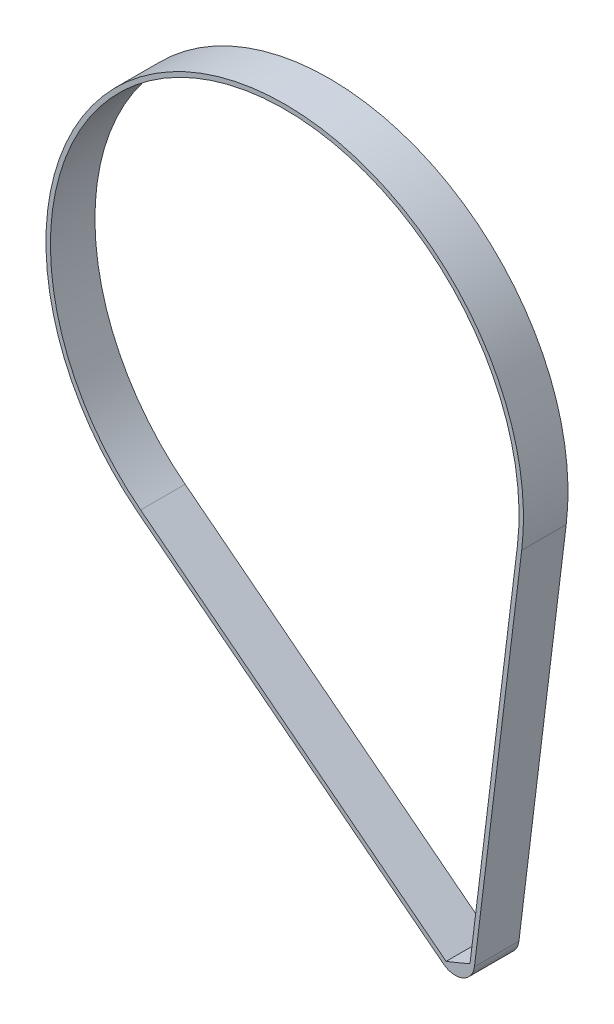
ISO-10303-21;
HEADER;
FILE_DESCRIPTION(('STEP AP214'),'2;1');
FILE_NAME('part.step','',(''),(''),'','','');
FILE_SCHEMA(('AUTOMOTIVE_DESIGN { 1 0 10303 214 1 1 1 1 }'));
ENDSEC;
DATA;
#1=APPLICATION_CONTEXT('core data for automotive mechanical design processes');
#2=APPLICATION_PROTOCOL_DEFINITION('international standard','automotive_design',2000,#1);
#3=PRODUCT_CONTEXT('',#1,'mechanical');
#4=PRODUCT('Part','Part','',(#3));
#5=PRODUCT_RELATED_PRODUCT_CATEGORY('part','',(#4));
#6=PRODUCT_DEFINITION_FORMATION('','',#4);
#7=PRODUCT_DEFINITION_CONTEXT('part definition',#1,'design');
#8=PRODUCT_DEFINITION('design','',#6,#7);
#9=PRODUCT_DEFINITION_SHAPE('','',#8);
#10=(LENGTH_UNIT() NAMED_UNIT(*) SI_UNIT(.MILLI.,.METRE.));
#11=(NAMED_UNIT(*) PLANE_ANGLE_UNIT() SI_UNIT($,.RADIAN.));
#12=(NAMED_UNIT(*) SI_UNIT($,.STERADIAN.) SOLID_ANGLE_UNIT());
#13=UNCERTAINTY_MEASURE_WITH_UNIT(LENGTH_MEASURE(1.E-05),#10,'distance_accuracy_value','');
#14=(GEOMETRIC_REPRESENTATION_CONTEXT(3) GLOBAL_UNCERTAINTY_ASSIGNED_CONTEXT((#13)) GLOBAL_UNIT_ASSIGNED_CONTEXT((#10,
#11,#12)) REPRESENTATION_CONTEXT('',''));
#15=CARTESIAN_POINT('',(0.,0.,0.));
#16=DIRECTION('',(0.,0.,1.));
#17=DIRECTION('',(1.,0.,0.));
#18=AXIS2_PLACEMENT_3D('',#15,#16,#17);
#19=CARTESIAN_POINT('',(0.,0.,-30.));
#20=DIRECTION('',(0.,0.,1.));
#21=DIRECTION('',(1.,0.,0.));
#22=AXIS2_PLACEMENT_3D('',#19,#20,#21);
#23=CYLINDRICAL_SURFACE('',#22,160.89);
#24=CARTESIAN_POINT('',(0.,0.,0.));
#25=DIRECTION('',(0.,0.,1.));
#26=DIRECTION('',(1.,0.,0.));
#27=AXIS2_PLACEMENT_3D('',#24,#25,#26);
#28=CIRCLE('',#27,160.89);
#29=CARTESIAN_POINT('',(159.686268065293,-19.6440294079285,0.));
#30=VERTEX_POINT('',#29);
#31=CARTESIAN_POINT('',(-98.9244243103607,-126.884003620881,0.));
#32=VERTEX_POINT('',#31);
#33=EDGE_CURVE('E133',#30,#32,#28,.T.);
#34=ORIENTED_EDGE('',*,*,#33,.F.);
#35=DIRECTION('',(0.,0.,1.));
#36=VECTOR('',#35,1.);
#37=CARTESIAN_POINT('',(159.686268065293,-19.6440294079285,-30.));
#38=LINE('',#37,#36);
#39=CARTESIAN_POINT('',(159.686268065293,-19.6440294079285,-30.));
#40=VERTEX_POINT('',#39);
#41=EDGE_CURVE('E11',#40,#30,#38,.T.);
#42=ORIENTED_EDGE('',*,*,#41,.F.);
#43=CARTESIAN_POINT('',(0.,0.,-30.));
#44=DIRECTION('',(0.,0.,1.));
#45=DIRECTION('',(1.,0.,0.));
#46=AXIS2_PLACEMENT_3D('',#43,#44,#45);
#47=CIRCLE('',#46,160.89);
#48=CARTESIAN_POINT('',(-98.9244243103607,-126.884003620881,-30.));
#49=VERTEX_POINT('',#48);
#50=EDGE_CURVE('E137',#40,#49,#47,.T.);
#51=ORIENTED_EDGE('',*,*,#50,.T.);
#52=DIRECTION('',(0.,0.,1.));
#53=VECTOR('',#52,1.);
#54=CARTESIAN_POINT('',(-98.9244243103607,-126.884003620881,-30.));
#55=LINE('',#54,#53);
#56=EDGE_CURVE('E38',#49,#32,#55,.T.);
#57=ORIENTED_EDGE('',*,*,#56,.T.);
#58=EDGE_LOOP('',(#34,#42,#51,#57));
#59=FACE_BOUND('',#58,.T.);
#60=ADVANCED_FACE('F35',(#59),#23,.T.);
#61=CARTESIAN_POINT('',(159.686268065293,-19.6440294079285,-30.));
#62=DIRECTION('',(0.992518292406566,-0.122096024662369,0.));
#63=DIRECTION('',(0.122096024662369,0.992518292406566,0.));
#64=AXIS2_PLACEMENT_3D('',#61,#62,#63);
#65=PLANE('',#64);
#66=DIRECTION('',(0.122096024662369,0.992518292406566,0.));
#67=VECTOR('',#66,1.);
#68=CARTESIAN_POINT('',(159.686268065293,-19.6440294079285,0.));
#69=LINE('',#68,#67);
#70=CARTESIAN_POINT('',(127.817440220257,-278.705654724731,0.));
#71=VERTEX_POINT('',#70);
#72=EDGE_CURVE('E141',#71,#30,#69,.T.);
#73=ORIENTED_EDGE('',*,*,#72,.F.);
#74=DIRECTION('',(0.,0.,1.));
#75=VECTOR('',#74,1.);
#76=CARTESIAN_POINT('',(127.817440220257,-278.705654724731,-30.));
#77=LINE('',#76,#75);
#78=CARTESIAN_POINT('',(127.817440220257,-278.705654724731,-30.));
#79=VERTEX_POINT('',#78);
#80=EDGE_CURVE('E43',#79,#71,#77,.T.);
#81=ORIENTED_EDGE('',*,*,#80,.F.);
#82=DIRECTION('',(0.122096024662369,0.992518292406566,0.));
#83=VECTOR('',#82,1.);
#84=CARTESIAN_POINT('',(159.686268065293,-19.6440294079285,-30.));
#85=LINE('',#84,#83);
#86=EDGE_CURVE('E147',#79,#40,#85,.T.);
#87=ORIENTED_EDGE('',*,*,#86,.T.);
#88=ORIENTED_EDGE('',*,*,#41,.T.);
#89=EDGE_LOOP('',(#73,#81,#87,#88));
#90=FACE_BOUND('',#89,.T.);
#91=ADVANCED_FACE('F173',(#90),#65,.T.);
#92=CARTESIAN_POINT('',(114.914702418971,-277.11840640412,-30.));
#93=DIRECTION('',(0.,0.,1.));
#94=DIRECTION('',(1.,0.,0.));
#95=AXIS2_PLACEMENT_3D('',#92,#93,#94);
#96=CYLINDRICAL_SURFACE('',#95,13.);
#97=CARTESIAN_POINT('',(114.914702418971,-277.11840640412,0.));
#98=DIRECTION('',(0.,0.,1.));
#99=DIRECTION('',(1.,0.,0.));
#100=AXIS2_PLACEMENT_3D('',#97,#98,#99);
#101=CIRCLE('',#100,13.);
#102=CARTESIAN_POINT('',(106.921554827234,-287.370703296851,0.));
#103=VERTEX_POINT('',#102);
#104=EDGE_CURVE('E155',#103,#71,#101,.T.);
#105=ORIENTED_EDGE('',*,*,#104,.F.);
#106=DIRECTION('',(0.,0.,1.));
#107=VECTOR('',#106,1.);
#108=CARTESIAN_POINT('',(106.921554827234,-287.370703296851,-30.));
#109=LINE('',#108,#107);
#110=CARTESIAN_POINT('',(106.921554827234,-287.370703296851,-30.));
#111=VERTEX_POINT('',#110);
#112=EDGE_CURVE('E160',#111,#103,#109,.T.);
#113=ORIENTED_EDGE('',*,*,#112,.F.);
#114=CARTESIAN_POINT('',(114.914702418971,-277.11840640412,-30.));
#115=DIRECTION('',(0.,0.,1.));
#116=DIRECTION('',(1.,0.,0.));
#117=AXIS2_PLACEMENT_3D('',#114,#115,#116);
#118=CIRCLE('',#117,13.);
#119=EDGE_CURVE('E144',#111,#79,#118,.T.);
#120=ORIENTED_EDGE('',*,*,#119,.T.);
#121=ORIENTED_EDGE('',*,*,#80,.T.);
#122=EDGE_LOOP('',(#105,#113,#120,#121));
#123=FACE_BOUND('',#122,.T.);
#124=ADVANCED_FACE('F177',(#123),#96,.T.);
#125=CARTESIAN_POINT('',(-98.9244243103607,-126.884003620881,-30.));
#126=DIRECTION('',(-0.614857507056751,-0.78863822251775,0.));
#127=DIRECTION('',(0.788638222517751,-0.614857507056751,0.));
#128=AXIS2_PLACEMENT_3D('',#125,#126,#127);
#129=PLANE('',#128);
#130=DIRECTION('',(0.788638222517751,-0.614857507056751,0.));
#131=VECTOR('',#130,1.);
#132=CARTESIAN_POINT('',(-98.9244243103607,-126.884003620881,0.));
#133=LINE('',#132,#131);
#134=EDGE_CURVE('E152',#32,#103,#133,.T.);
#135=ORIENTED_EDGE('',*,*,#134,.F.);
#136=ORIENTED_EDGE('',*,*,#56,.F.);
#137=DIRECTION('',(0.788638222517751,-0.614857507056751,0.));
#138=VECTOR('',#137,1.);
#139=CARTESIAN_POINT('',(-98.9244243103607,-126.884003620881,-30.));
#140=LINE('',#139,#138);
#141=EDGE_CURVE('E140',#49,#111,#140,.T.);
#142=ORIENTED_EDGE('',*,*,#141,.T.);
#143=ORIENTED_EDGE('',*,*,#112,.T.);
#144=EDGE_LOOP('',(#135,#136,#142,#143));
#145=FACE_BOUND('',#144,.T.);
#146=ADVANCED_FACE('F168',(#145),#129,.T.);
#147=CARTESIAN_POINT('',(0.,0.,-30.));
#148=DIRECTION('',(0.,0.,1.));
#149=DIRECTION('',(1.,0.,0.));
#150=AXIS2_PLACEMENT_3D('',#147,#148,#149);
#151=PLANE('',#150);
#152=DIRECTION('',(0.122096024662369,0.992518292406566,0.));
#153=VECTOR('',#152,1.);
#154=CARTESIAN_POINT('',(156.708713188073,-19.2777413339414,-30.));
#155=LINE('',#154,#153);
#156=CARTESIAN_POINT('',(124.839885343037,-278.339366650744,-30.));
#157=VERTEX_POINT('',#156);
#158=CARTESIAN_POINT('',(156.708713188073,-19.2777413339414,-30.));
#159=VERTEX_POINT('',#158);
#160=EDGE_CURVE('E108',#157,#159,#155,.T.);
#161=ORIENTED_EDGE('',*,*,#160,.T.);
#162=CARTESIAN_POINT('',(0.,0.,-30.));
#163=DIRECTION('',(0.,0.,1.));
#164=DIRECTION('',(1.,0.,0.));
#165=AXIS2_PLACEMENT_3D('',#162,#163,#164);
#166=CIRCLE('',#165,157.89);
#167=CARTESIAN_POINT('',(-97.0798517891905,-124.518088953328,-30.));
#168=VERTEX_POINT('',#167);
#169=EDGE_CURVE('E102',#159,#168,#166,.T.);
#170=ORIENTED_EDGE('',*,*,#169,.T.);
#171=DIRECTION('',(0.788638222517751,-0.614857507056751,0.));
#172=VECTOR('',#171,1.);
#173=CARTESIAN_POINT('',(-97.0798517891905,-124.518088953328,-30.));
#174=LINE('',#173,#172);
#175=CARTESIAN_POINT('',(108.766127348404,-285.004788629298,-30.));
#176=VERTEX_POINT('',#175);
#177=EDGE_CURVE('E111',#168,#176,#174,.T.);
#178=ORIENTED_EDGE('',*,*,#177,.T.);
#179=CARTESIAN_POINT('',(-47.3103829858905,114.089647916576,-30.));
#180=DIRECTION('',(0.,0.,1.));
#181=DIRECTION('',(1.,0.,0.));
#182=AXIS2_PLACEMENT_3D('',#179,#180,#181);
#183=CIRCLE('',#182,428.527999505283);
#184=EDGE_CURVE('E51',#176,#157,#183,.T.);
#185=ORIENTED_EDGE('',*,*,#184,.T.);
#186=EDGE_LOOP('',(#161,#170,#178,#185));
#187=FACE_BOUND('',#186,.T.);
#188=ORIENTED_EDGE('',*,*,#50,.F.);
#189=ORIENTED_EDGE('',*,*,#86,.F.);
#190=ORIENTED_EDGE('',*,*,#119,.F.);
#191=ORIENTED_EDGE('',*,*,#141,.F.);
#192=EDGE_LOOP('',(#188,#189,#190,#191));
#193=FACE_BOUND('',#192,.T.);
#194=ADVANCED_FACE('F115',(#187,#193),#151,.F.);
#195=CARTESIAN_POINT('',(0.,0.,0.));
#196=DIRECTION('',(0.,0.,1.));
#197=DIRECTION('',(1.,0.,0.));
#198=AXIS2_PLACEMENT_3D('',#195,#196,#197);
#199=PLANE('',#198);
#200=CARTESIAN_POINT('',(0.,0.,0.));
#201=DIRECTION('',(0.,0.,1.));
#202=DIRECTION('',(1.,0.,0.));
#203=AXIS2_PLACEMENT_3D('',#200,#201,#202);
#204=CIRCLE('',#203,157.89);
#205=CARTESIAN_POINT('',(156.708713188073,-19.2777413339414,0.));
#206=VERTEX_POINT('',#205);
#207=CARTESIAN_POINT('',(-97.0798517891905,-124.518088953328,0.));
#208=VERTEX_POINT('',#207);
#209=EDGE_CURVE('E59',#206,#208,#204,.T.);
#210=ORIENTED_EDGE('',*,*,#209,.F.);
#211=DIRECTION('',(0.122096024662369,0.992518292406566,0.));
#212=VECTOR('',#211,1.);
#213=CARTESIAN_POINT('',(156.708713188073,-19.2777413339414,0.));
#214=LINE('',#213,#212);
#215=CARTESIAN_POINT('',(124.839885343037,-278.339366650744,0.));
#216=VERTEX_POINT('',#215);
#217=EDGE_CURVE('E118',#216,#206,#214,.T.);
#218=ORIENTED_EDGE('',*,*,#217,.F.);
#219=CARTESIAN_POINT('',(-47.3103829858905,114.089647916576,0.));
#220=DIRECTION('',(0.,0.,1.));
#221=DIRECTION('',(1.,0.,0.));
#222=AXIS2_PLACEMENT_3D('',#219,#220,#221);
#223=CIRCLE('',#222,428.527999505283);
#224=CARTESIAN_POINT('',(108.766127348404,-285.004788629298,0.));
#225=VERTEX_POINT('',#224);
#226=EDGE_CURVE('E121',#225,#216,#223,.T.);
#227=ORIENTED_EDGE('',*,*,#226,.F.);
#228=DIRECTION('',(0.788638222517751,-0.614857507056751,0.));
#229=VECTOR('',#228,1.);
#230=CARTESIAN_POINT('',(-97.0798517891905,-124.518088953328,0.));
#231=LINE('',#230,#229);
#232=EDGE_CURVE('E127',#208,#225,#231,.T.);
#233=ORIENTED_EDGE('',*,*,#232,.F.);
#234=EDGE_LOOP('',(#210,#218,#227,#233));
#235=FACE_BOUND('',#234,.T.);
#236=ORIENTED_EDGE('',*,*,#33,.T.);
#237=ORIENTED_EDGE('',*,*,#134,.T.);
#238=ORIENTED_EDGE('',*,*,#104,.T.);
#239=ORIENTED_EDGE('',*,*,#72,.T.);
#240=EDGE_LOOP('',(#236,#237,#238,#239));
#241=FACE_BOUND('',#240,.T.);
#242=ADVANCED_FACE('F170',(#235,#241),#199,.T.);
#243=CARTESIAN_POINT('',(0.,0.,-30.));
#244=DIRECTION('',(0.,0.,1.));
#245=DIRECTION('',(1.,0.,0.));
#246=AXIS2_PLACEMENT_3D('',#243,#244,#245);
#247=CYLINDRICAL_SURFACE('',#246,157.89);
#248=ORIENTED_EDGE('',*,*,#209,.T.);
#249=DIRECTION('',(0.,0.,1.));
#250=VECTOR('',#249,1.);
#251=CARTESIAN_POINT('',(-97.0798517891905,-124.518088953328,-30.));
#252=LINE('',#251,#250);
#253=EDGE_CURVE('E98',#168,#208,#252,.T.);
#254=ORIENTED_EDGE('',*,*,#253,.F.);
#255=ORIENTED_EDGE('',*,*,#169,.F.);
#256=DIRECTION('',(0.,0.,1.));
#257=VECTOR('',#256,1.);
#258=CARTESIAN_POINT('',(156.708713188073,-19.2777413339414,-30.));
#259=LINE('',#258,#257);
#260=EDGE_CURVE('E131',#159,#206,#259,.T.);
#261=ORIENTED_EDGE('',*,*,#260,.T.);
#262=EDGE_LOOP('',(#248,#254,#255,#261));
#263=FACE_BOUND('',#262,.T.);
#264=ADVANCED_FACE('F100',(#263),#247,.F.);
#265=CARTESIAN_POINT('',(156.708713188073,-19.2777413339414,-30.));
#266=DIRECTION('',(0.992518292406566,-0.122096024662369,0.));
#267=DIRECTION('',(0.122096024662369,0.992518292406566,0.));
#268=AXIS2_PLACEMENT_3D('',#265,#266,#267);
#269=PLANE('',#268);
#270=ORIENTED_EDGE('',*,*,#217,.T.);
#271=ORIENTED_EDGE('',*,*,#260,.F.);
#272=ORIENTED_EDGE('',*,*,#160,.F.);
#273=DIRECTION('',(0.,0.,1.));
#274=VECTOR('',#273,1.);
#275=CARTESIAN_POINT('',(124.839885343037,-278.339366650744,-30.));
#276=LINE('',#275,#274);
#277=EDGE_CURVE('E134',#157,#216,#276,.T.);
#278=ORIENTED_EDGE('',*,*,#277,.T.);
#279=EDGE_LOOP('',(#270,#271,#272,#278));
#280=FACE_BOUND('',#279,.T.);
#281=ADVANCED_FACE('F228',(#280),#269,.F.);
#282=CARTESIAN_POINT('',(-47.3103829858905,114.089647916576,-30.));
#283=DIRECTION('',(0.,0.,1.));
#284=DIRECTION('',(1.,0.,0.));
#285=AXIS2_PLACEMENT_3D('',#282,#283,#284);
#286=CYLINDRICAL_SURFACE('',#285,428.527999505283);
#287=ORIENTED_EDGE('',*,*,#226,.T.);
#288=ORIENTED_EDGE('',*,*,#277,.F.);
#289=ORIENTED_EDGE('',*,*,#184,.F.);
#290=DIRECTION('',(0.,0.,1.));
#291=VECTOR('',#290,1.);
#292=CARTESIAN_POINT('',(108.766127348404,-285.004788629298,-30.));
#293=LINE('',#292,#291);
#294=EDGE_CURVE('E107',#176,#225,#293,.T.);
#295=ORIENTED_EDGE('',*,*,#294,.T.);
#296=EDGE_LOOP('',(#287,#288,#289,#295));
#297=FACE_BOUND('',#296,.T.);
#298=ADVANCED_FACE('F237',(#297),#286,.F.);
#299=CARTESIAN_POINT('',(-97.0798517891905,-124.518088953328,-30.));
#300=DIRECTION('',(-0.614857507056751,-0.78863822251775,0.));
#301=DIRECTION('',(0.788638222517751,-0.614857507056751,0.));
#302=AXIS2_PLACEMENT_3D('',#299,#300,#301);
#303=PLANE('',#302);
#304=ORIENTED_EDGE('',*,*,#232,.T.);
#305=ORIENTED_EDGE('',*,*,#294,.F.);
#306=ORIENTED_EDGE('',*,*,#177,.F.);
#307=ORIENTED_EDGE('',*,*,#253,.T.);
#308=EDGE_LOOP('',(#304,#305,#306,#307));
#309=FACE_BOUND('',#308,.T.);
#310=ADVANCED_FACE('F112',(#309),#303,.F.);
#311=CLOSED_SHELL('',(#60,#91,#124,#146,#194,#242,#264,#281,#298,#310));
#312=MANIFOLD_SOLID_BREP('B2',#311);
#313=ADVANCED_BREP_SHAPE_REPRESENTATION('',(#18,#312),#14);
#314=SHAPE_DEFINITION_REPRESENTATION(#9,#313);
ENDSEC;
END-ISO-10303-21;
